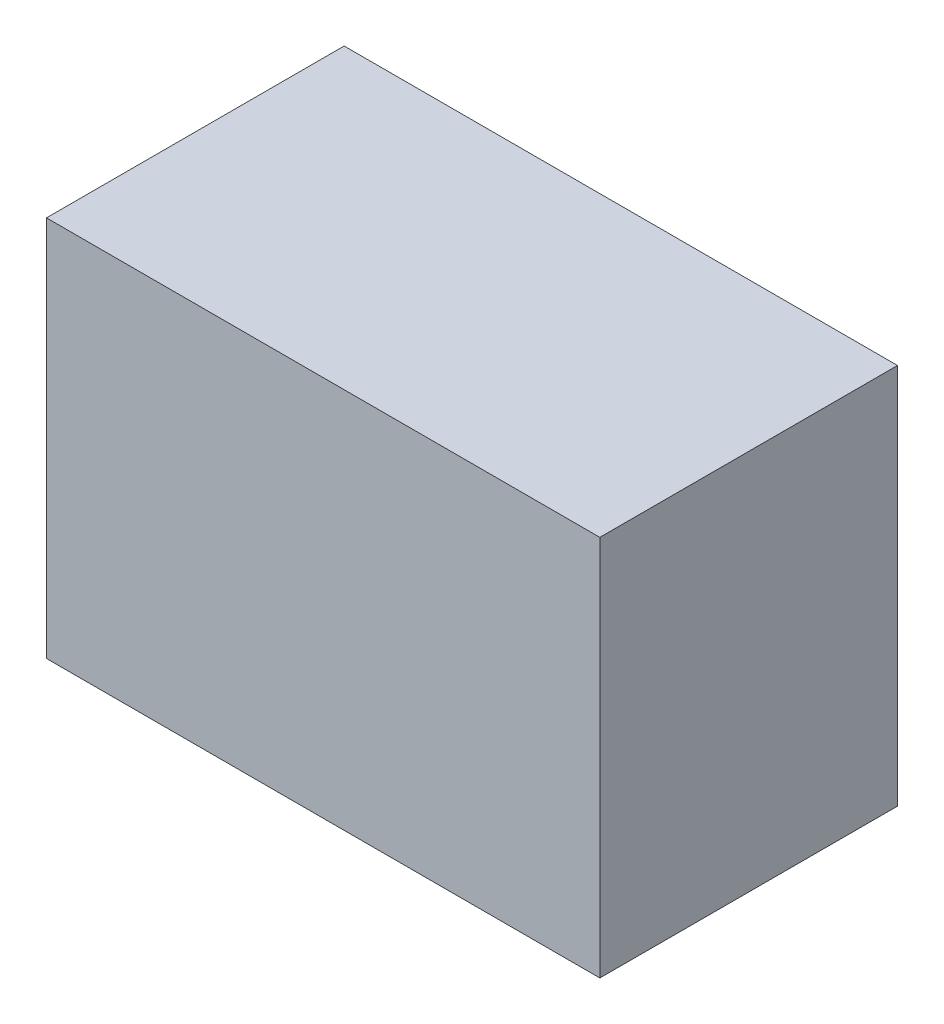
ISO-10303-21;
HEADER;
FILE_DESCRIPTION(('STEP AP214'),'2;1');
FILE_NAME('part.step','',(''),(''),'','','');
FILE_SCHEMA(('AUTOMOTIVE_DESIGN { 1 0 10303 214 1 1 1 1 }'));
ENDSEC;
DATA;
#1=APPLICATION_CONTEXT('core data for automotive mechanical design processes');
#2=APPLICATION_PROTOCOL_DEFINITION('international standard','automotive_design',2000,#1);
#3=PRODUCT_CONTEXT('',#1,'mechanical');
#4=PRODUCT('Part','Part','',(#3));
#5=PRODUCT_RELATED_PRODUCT_CATEGORY('part','',(#4));
#6=PRODUCT_DEFINITION_FORMATION('','',#4);
#7=PRODUCT_DEFINITION_CONTEXT('part definition',#1,'design');
#8=PRODUCT_DEFINITION('design','',#6,#7);
#9=PRODUCT_DEFINITION_SHAPE('','',#8);
#10=(LENGTH_UNIT() NAMED_UNIT(*) SI_UNIT(.MILLI.,.METRE.));
#11=(NAMED_UNIT(*) PLANE_ANGLE_UNIT() SI_UNIT($,.RADIAN.));
#12=(NAMED_UNIT(*) SI_UNIT($,.STERADIAN.) SOLID_ANGLE_UNIT());
#13=UNCERTAINTY_MEASURE_WITH_UNIT(LENGTH_MEASURE(1.E-05),#10,'distance_accuracy_value','');
#14=(GEOMETRIC_REPRESENTATION_CONTEXT(3) GLOBAL_UNCERTAINTY_ASSIGNED_CONTEXT((#13)) GLOBAL_UNIT_ASSIGNED_CONTEXT((#10,
#11,#12)) REPRESENTATION_CONTEXT('',''));
#15=CARTESIAN_POINT('',(0.,0.,0.));
#16=DIRECTION('',(0.,0.,1.));
#17=DIRECTION('',(1.,0.,0.));
#18=AXIS2_PLACEMENT_3D('',#15,#16,#17);
#19=CARTESIAN_POINT('',(600.,72.4999999999983,78.));
#20=DIRECTION('',(-1.,0.,0.));
#21=DIRECTION('',(0.,0.,1.));
#22=AXIS2_PLACEMENT_3D('',#19,#20,#21);
#23=PLANE('',#22);
#24=DIRECTION('',(0.,1.,0.));
#25=VECTOR('',#24,1.);
#26=CARTESIAN_POINT('',(600.,72.4999999999983,0.));
#27=LINE('',#26,#25);
#28=CARTESIAN_POINT('',(600.,-27.5000000000017,0.));
#29=VERTEX_POINT('',#28);
#30=CARTESIAN_POINT('',(600.,72.4999999999983,0.));
#31=VERTEX_POINT('',#30);
#32=EDGE_CURVE('E95',#29,#31,#27,.T.);
#33=ORIENTED_EDGE('',*,*,#32,.T.);
#34=DIRECTION('',(0.,0.,-1.));
#35=VECTOR('',#34,1.);
#36=CARTESIAN_POINT('',(600.,72.4999999999983,78.));
#37=LINE('',#36,#35);
#38=CARTESIAN_POINT('',(600.,72.4999999999983,78.));
#39=VERTEX_POINT('',#38);
#40=EDGE_CURVE('E11',#39,#31,#37,.T.);
#41=ORIENTED_EDGE('',*,*,#40,.F.);
#42=DIRECTION('',(0.,1.,0.));
#43=VECTOR('',#42,1.);
#44=CARTESIAN_POINT('',(600.,72.4999999999983,78.));
#45=LINE('',#44,#43);
#46=CARTESIAN_POINT('',(600.,-27.5000000000017,78.));
#47=VERTEX_POINT('',#46);
#48=EDGE_CURVE('E83',#47,#39,#45,.T.);
#49=ORIENTED_EDGE('',*,*,#48,.F.);
#50=DIRECTION('',(0.,0.,-1.));
#51=VECTOR('',#50,1.);
#52=CARTESIAN_POINT('',(600.,-27.5000000000017,78.));
#53=LINE('',#52,#51);
#54=EDGE_CURVE('E91',#47,#29,#53,.T.);
#55=ORIENTED_EDGE('',*,*,#54,.T.);
#56=EDGE_LOOP('',(#33,#41,#49,#55));
#57=FACE_BOUND('',#56,.T.);
#58=ADVANCED_FACE('F32',(#57),#23,.F.);
#59=CARTESIAN_POINT('',(600.,72.4999999999983,78.));
#60=DIRECTION('',(0.,-1.,0.));
#61=DIRECTION('',(0.,0.,-1.));
#62=AXIS2_PLACEMENT_3D('',#59,#60,#61);
#63=PLANE('',#62);
#64=DIRECTION('',(-1.,0.,0.));
#65=VECTOR('',#64,1.);
#66=CARTESIAN_POINT('',(600.,72.4999999999983,0.));
#67=LINE('',#66,#65);
#68=CARTESIAN_POINT('',(455.,72.4999999999983,0.));
#69=VERTEX_POINT('',#68);
#70=EDGE_CURVE('E87',#31,#69,#67,.T.);
#71=ORIENTED_EDGE('',*,*,#70,.T.);
#72=DIRECTION('',(0.,0.,-1.));
#73=VECTOR('',#72,1.);
#74=CARTESIAN_POINT('',(455.,72.4999999999983,78.));
#75=LINE('',#74,#73);
#76=CARTESIAN_POINT('',(455.,72.4999999999983,78.));
#77=VERTEX_POINT('',#76);
#78=EDGE_CURVE('E40',#77,#69,#75,.T.);
#79=ORIENTED_EDGE('',*,*,#78,.F.);
#80=DIRECTION('',(-1.,0.,0.));
#81=VECTOR('',#80,1.);
#82=CARTESIAN_POINT('',(600.,72.4999999999983,78.));
#83=LINE('',#82,#81);
#84=EDGE_CURVE('E78',#39,#77,#83,.T.);
#85=ORIENTED_EDGE('',*,*,#84,.F.);
#86=ORIENTED_EDGE('',*,*,#40,.T.);
#87=EDGE_LOOP('',(#71,#79,#85,#86));
#88=FACE_BOUND('',#87,.T.);
#89=ADVANCED_FACE('F86',(#88),#63,.F.);
#90=CARTESIAN_POINT('',(455.,72.4999999999983,78.));
#91=DIRECTION('',(1.,0.,0.));
#92=DIRECTION('',(0.,0.,-1.));
#93=AXIS2_PLACEMENT_3D('',#90,#91,#92);
#94=PLANE('',#93);
#95=DIRECTION('',(0.,-1.,0.));
#96=VECTOR('',#95,1.);
#97=CARTESIAN_POINT('',(455.,72.4999999999983,0.));
#98=LINE('',#97,#96);
#99=CARTESIAN_POINT('',(455.,-27.5000000000017,0.));
#100=VERTEX_POINT('',#99);
#101=EDGE_CURVE('E65',#69,#100,#98,.T.);
#102=ORIENTED_EDGE('',*,*,#101,.T.);
#103=DIRECTION('',(0.,0.,-1.));
#104=VECTOR('',#103,1.);
#105=CARTESIAN_POINT('',(455.,-27.5000000000017,78.));
#106=LINE('',#105,#104);
#107=CARTESIAN_POINT('',(455.,-27.5000000000017,78.));
#108=VERTEX_POINT('',#107);
#109=EDGE_CURVE('E88',#108,#100,#106,.T.);
#110=ORIENTED_EDGE('',*,*,#109,.F.);
#111=DIRECTION('',(0.,-1.,0.));
#112=VECTOR('',#111,1.);
#113=CARTESIAN_POINT('',(455.,72.4999999999983,78.));
#114=LINE('',#113,#112);
#115=EDGE_CURVE('E81',#77,#108,#114,.T.);
#116=ORIENTED_EDGE('',*,*,#115,.F.);
#117=ORIENTED_EDGE('',*,*,#78,.T.);
#118=EDGE_LOOP('',(#102,#110,#116,#117));
#119=FACE_BOUND('',#118,.T.);
#120=ADVANCED_FACE('F89',(#119),#94,.F.);
#121=CARTESIAN_POINT('',(600.,-27.5000000000017,78.));
#122=DIRECTION('',(0.,1.,0.));
#123=DIRECTION('',(-1.,0.,0.));
#124=AXIS2_PLACEMENT_3D('',#121,#122,#123);
#125=PLANE('',#124);
#126=DIRECTION('',(1.,0.,0.));
#127=VECTOR('',#126,1.);
#128=CARTESIAN_POINT('',(600.,-27.5000000000017,0.));
#129=LINE('',#128,#127);
#130=EDGE_CURVE('E71',#100,#29,#129,.T.);
#131=ORIENTED_EDGE('',*,*,#130,.T.);
#132=ORIENTED_EDGE('',*,*,#54,.F.);
#133=DIRECTION('',(1.,0.,0.));
#134=VECTOR('',#133,1.);
#135=CARTESIAN_POINT('',(600.,-27.5000000000017,78.));
#136=LINE('',#135,#134);
#137=EDGE_CURVE('E48',#108,#47,#136,.T.);
#138=ORIENTED_EDGE('',*,*,#137,.F.);
#139=ORIENTED_EDGE('',*,*,#109,.T.);
#140=EDGE_LOOP('',(#131,#132,#138,#139));
#141=FACE_BOUND('',#140,.T.);
#142=ADVANCED_FACE('F102',(#141),#125,.F.);
#143=CARTESIAN_POINT('',(600.,-27.5000000000017,78.));
#144=DIRECTION('',(0.,0.,-1.));
#145=DIRECTION('',(-1.,0.,0.));
#146=AXIS2_PLACEMENT_3D('',#143,#144,#145);
#147=PLANE('',#146);
#148=ORIENTED_EDGE('',*,*,#48,.T.);
#149=ORIENTED_EDGE('',*,*,#84,.T.);
#150=ORIENTED_EDGE('',*,*,#115,.T.);
#151=ORIENTED_EDGE('',*,*,#137,.T.);
#152=EDGE_LOOP('',(#148,#149,#150,#151));
#153=FACE_BOUND('',#152,.T.);
#154=ADVANCED_FACE('F79',(#153),#147,.F.);
#155=CARTESIAN_POINT('',(600.,-27.5000000000017,0.));
#156=DIRECTION('',(0.,0.,-1.));
#157=DIRECTION('',(-1.,0.,0.));
#158=AXIS2_PLACEMENT_3D('',#155,#156,#157);
#159=PLANE('',#158);
#160=ORIENTED_EDGE('',*,*,#32,.F.);
#161=ORIENTED_EDGE('',*,*,#130,.F.);
#162=ORIENTED_EDGE('',*,*,#101,.F.);
#163=ORIENTED_EDGE('',*,*,#70,.F.);
#164=EDGE_LOOP('',(#160,#161,#162,#163));
#165=FACE_BOUND('',#164,.T.);
#166=ADVANCED_FACE('F105',(#165),#159,.T.);
#167=CLOSED_SHELL('',(#58,#89,#120,#142,#154,#166));
#168=MANIFOLD_SOLID_BREP('B2',#167);
#169=ADVANCED_BREP_SHAPE_REPRESENTATION('',(#18,#168),#14);
#170=SHAPE_DEFINITION_REPRESENTATION(#9,#169);
ENDSEC;
END-ISO-10303-21;
